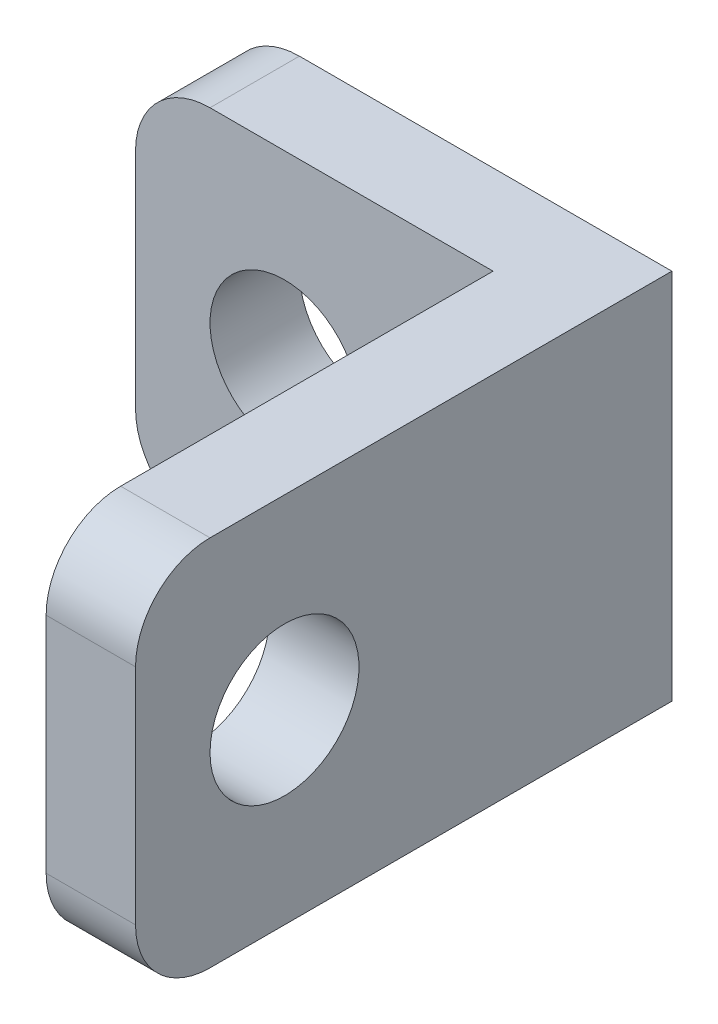
ISO-10303-21;
HEADER;
FILE_DESCRIPTION(('STEP AP214'),'2;1');
FILE_NAME('part.step','',(''),(''),'','','');
FILE_SCHEMA(('AUTOMOTIVE_DESIGN { 1 0 10303 214 1 1 1 1 }'));
ENDSEC;
DATA;
#1=APPLICATION_CONTEXT('core data for automotive mechanical design processes');
#2=APPLICATION_PROTOCOL_DEFINITION('international standard','automotive_design',2000,#1);
#3=PRODUCT_CONTEXT('',#1,'mechanical');
#4=PRODUCT('Part','Part','',(#3));
#5=PRODUCT_RELATED_PRODUCT_CATEGORY('part','',(#4));
#6=PRODUCT_DEFINITION_FORMATION('','',#4);
#7=PRODUCT_DEFINITION_CONTEXT('part definition',#1,'design');
#8=PRODUCT_DEFINITION('design','',#6,#7);
#9=PRODUCT_DEFINITION_SHAPE('','',#8);
#10=(LENGTH_UNIT() NAMED_UNIT(*) SI_UNIT(.MILLI.,.METRE.));
#11=(NAMED_UNIT(*) PLANE_ANGLE_UNIT() SI_UNIT($,.RADIAN.));
#12=(NAMED_UNIT(*) SI_UNIT($,.STERADIAN.) SOLID_ANGLE_UNIT());
#13=UNCERTAINTY_MEASURE_WITH_UNIT(LENGTH_MEASURE(1.E-05),#10,'distance_accuracy_value','');
#14=(GEOMETRIC_REPRESENTATION_CONTEXT(3) GLOBAL_UNCERTAINTY_ASSIGNED_CONTEXT((#13)) GLOBAL_UNIT_ASSIGNED_CONTEXT((#10,
#11,#12)) REPRESENTATION_CONTEXT('',''));
#15=CARTESIAN_POINT('',(0.,0.,0.));
#16=DIRECTION('',(0.,0.,1.));
#17=DIRECTION('',(1.,0.,0.));
#18=AXIS2_PLACEMENT_3D('',#15,#16,#17);
#19=CARTESIAN_POINT('',(1.,4.,1.2));
#20=DIRECTION('',(0.,0.,-1.));
#21=DIRECTION('',(-1.,0.,0.));
#22=AXIS2_PLACEMENT_3D('',#19,#20,#21);
#23=PLANE('',#22);
#24=DIRECTION('',(1.,0.,0.));
#25=VECTOR('',#24,1.);
#26=CARTESIAN_POINT('',(1.00000000000001,0.,1.2));
#27=LINE('',#26,#25);
#28=CARTESIAN_POINT('',(1.00000000000001,0.,1.2));
#29=VERTEX_POINT('',#28);
#30=CARTESIAN_POINT('',(4.8,0.,1.2));
#31=VERTEX_POINT('',#30);
#32=EDGE_CURVE('E123',#29,#31,#27,.T.);
#33=ORIENTED_EDGE('',*,*,#32,.T.);
#34=DIRECTION('',(0.,1.,0.));
#35=VECTOR('',#34,1.);
#36=CARTESIAN_POINT('',(4.8,0.,1.2));
#37=LINE('',#36,#35);
#38=CARTESIAN_POINT('',(4.8,5.,1.2));
#39=VERTEX_POINT('',#38);
#40=EDGE_CURVE('E131',#31,#39,#37,.T.);
#41=ORIENTED_EDGE('',*,*,#40,.T.);
#42=DIRECTION('',(-1.,0.,0.));
#43=VECTOR('',#42,1.);
#44=CARTESIAN_POINT('',(1.,5.,1.2));
#45=LINE('',#44,#43);
#46=CARTESIAN_POINT('',(1.,5.,1.2));
#47=VERTEX_POINT('',#46);
#48=EDGE_CURVE('E165',#39,#47,#45,.T.);
#49=ORIENTED_EDGE('',*,*,#48,.T.);
#50=CARTESIAN_POINT('',(1.,4.,1.2));
#51=DIRECTION('',(0.,0.,1.));
#52=DIRECTION('',(-1.,0.,0.));
#53=AXIS2_PLACEMENT_3D('',#50,#51,#52);
#54=CIRCLE('',#53,1.);
#55=CARTESIAN_POINT('',(0.,4.,1.2));
#56=VERTEX_POINT('',#55);
#57=EDGE_CURVE('E209',#47,#56,#54,.T.);
#58=ORIENTED_EDGE('',*,*,#57,.T.);
#59=DIRECTION('',(0.,-1.,0.));
#60=VECTOR('',#59,1.);
#61=CARTESIAN_POINT('',(0.,1.00000000000001,1.2));
#62=LINE('',#61,#60);
#63=CARTESIAN_POINT('',(0.,1.00000000000001,1.2));
#64=VERTEX_POINT('',#63);
#65=EDGE_CURVE('E147',#56,#64,#62,.T.);
#66=ORIENTED_EDGE('',*,*,#65,.T.);
#67=CARTESIAN_POINT('',(1.,1.,1.2));
#68=DIRECTION('',(0.,0.,1.));
#69=DIRECTION('',(-1.,0.,0.));
#70=AXIS2_PLACEMENT_3D('',#67,#68,#69);
#71=CIRCLE('',#70,1.);
#72=EDGE_CURVE('E141',#64,#29,#71,.T.);
#73=ORIENTED_EDGE('',*,*,#72,.T.);
#74=EDGE_LOOP('',(#33,#41,#49,#58,#66,#73));
#75=FACE_BOUND('',#74,.T.);
#76=CARTESIAN_POINT('',(2.,2.5,1.2));
#77=DIRECTION('',(0.,0.,1.));
#78=DIRECTION('',(1.,0.,0.));
#79=AXIS2_PLACEMENT_3D('',#76,#77,#78);
#80=CIRCLE('',#79,1.);
#81=CARTESIAN_POINT('',(3.,2.5,1.2));
#82=VERTEX_POINT('',#81);
#83=EDGE_CURVE('E155',#82,#82,#80,.T.);
#84=ORIENTED_EDGE('',*,*,#83,.F.);
#85=EDGE_LOOP('',(#84));
#86=FACE_BOUND('',#85,.T.);
#87=ADVANCED_FACE('F37',(#75,#86),#23,.F.);
#88=CARTESIAN_POINT('',(1.,4.,0.));
#89=DIRECTION('',(0.,0.,-1.));
#90=DIRECTION('',(-1.,0.,0.));
#91=AXIS2_PLACEMENT_3D('',#88,#89,#90);
#92=PLANE('',#91);
#93=DIRECTION('',(0.,1.,0.));
#94=VECTOR('',#93,1.);
#95=CARTESIAN_POINT('',(6.,0.,0.));
#96=LINE('',#95,#94);
#97=CARTESIAN_POINT('',(6.,0.,0.));
#98=VERTEX_POINT('',#97);
#99=CARTESIAN_POINT('',(6.,5.,0.));
#100=VERTEX_POINT('',#99);
#101=EDGE_CURVE('E151',#98,#100,#96,.T.);
#102=ORIENTED_EDGE('',*,*,#101,.F.);
#103=DIRECTION('',(1.,0.,0.));
#104=VECTOR('',#103,1.);
#105=CARTESIAN_POINT('',(1.00000000000001,0.,0.));
#106=LINE('',#105,#104);
#107=CARTESIAN_POINT('',(1.00000000000001,0.,0.));
#108=VERTEX_POINT('',#107);
#109=EDGE_CURVE('E163',#108,#98,#106,.T.);
#110=ORIENTED_EDGE('',*,*,#109,.F.);
#111=CARTESIAN_POINT('',(1.,1.,0.));
#112=DIRECTION('',(0.,0.,1.));
#113=DIRECTION('',(-1.,0.,0.));
#114=AXIS2_PLACEMENT_3D('',#111,#112,#113);
#115=CIRCLE('',#114,1.);
#116=CARTESIAN_POINT('',(0.,1.00000000000001,0.));
#117=VERTEX_POINT('',#116);
#118=EDGE_CURVE('E161',#117,#108,#115,.T.);
#119=ORIENTED_EDGE('',*,*,#118,.F.);
#120=DIRECTION('',(0.,-1.,0.));
#121=VECTOR('',#120,1.);
#122=CARTESIAN_POINT('',(0.,1.00000000000001,0.));
#123=LINE('',#122,#121);
#124=CARTESIAN_POINT('',(0.,4.,0.));
#125=VERTEX_POINT('',#124);
#126=EDGE_CURVE('E159',#125,#117,#123,.T.);
#127=ORIENTED_EDGE('',*,*,#126,.F.);
#128=CARTESIAN_POINT('',(1.,4.,0.));
#129=DIRECTION('',(0.,0.,1.));
#130=DIRECTION('',(-1.,0.,0.));
#131=AXIS2_PLACEMENT_3D('',#128,#129,#130);
#132=CIRCLE('',#131,1.);
#133=CARTESIAN_POINT('',(1.,5.,0.));
#134=VERTEX_POINT('',#133);
#135=EDGE_CURVE('E157',#134,#125,#132,.T.);
#136=ORIENTED_EDGE('',*,*,#135,.F.);
#137=DIRECTION('',(-1.,0.,0.));
#138=VECTOR('',#137,1.);
#139=CARTESIAN_POINT('',(1.,5.,0.));
#140=LINE('',#139,#138);
#141=EDGE_CURVE('E154',#100,#134,#140,.T.);
#142=ORIENTED_EDGE('',*,*,#141,.F.);
#143=EDGE_LOOP('',(#102,#110,#119,#127,#136,#142));
#144=FACE_BOUND('',#143,.T.);
#145=CARTESIAN_POINT('',(2.,2.5,0.));
#146=DIRECTION('',(0.,0.,1.));
#147=DIRECTION('',(1.,0.,0.));
#148=AXIS2_PLACEMENT_3D('',#145,#146,#147);
#149=CIRCLE('',#148,1.);
#150=CARTESIAN_POINT('',(3.,2.5,0.));
#151=VERTEX_POINT('',#150);
#152=EDGE_CURVE('E127',#151,#151,#149,.T.);
#153=ORIENTED_EDGE('',*,*,#152,.T.);
#154=EDGE_LOOP('',(#153));
#155=FACE_BOUND('',#154,.T.);
#156=ADVANCED_FACE('F221',(#144,#155),#92,.T.);
#157=CARTESIAN_POINT('',(6.,0.,1.2));
#158=DIRECTION('',(-1.,0.,0.));
#159=DIRECTION('',(0.,0.,1.));
#160=AXIS2_PLACEMENT_3D('',#157,#158,#159);
#161=PLANE('',#160);
#162=CARTESIAN_POINT('',(6.,2.5,5.2));
#163=DIRECTION('',(-1.,0.,0.));
#164=DIRECTION('',(0.,0.,1.));
#165=AXIS2_PLACEMENT_3D('',#162,#163,#164);
#166=CIRCLE('',#165,0.999999999999998);
#167=CARTESIAN_POINT('',(6.,2.5,6.2));
#168=VERTEX_POINT('',#167);
#169=EDGE_CURVE('E137',#168,#168,#166,.T.);
#170=ORIENTED_EDGE('',*,*,#169,.T.);
#171=EDGE_LOOP('',(#170));
#172=FACE_BOUND('',#171,.T.);
#173=DIRECTION('',(0.,-1.,0.));
#174=VECTOR('',#173,1.);
#175=CARTESIAN_POINT('',(6.,0.,7.2));
#176=LINE('',#175,#174);
#177=CARTESIAN_POINT('',(6.,4.,7.2));
#178=VERTEX_POINT('',#177);
#179=CARTESIAN_POINT('',(6.,1.,7.2));
#180=VERTEX_POINT('',#179);
#181=EDGE_CURVE('E190',#178,#180,#176,.T.);
#182=ORIENTED_EDGE('',*,*,#181,.T.);
#183=CARTESIAN_POINT('',(6.,1.,6.2));
#184=DIRECTION('',(-1.,0.,0.));
#185=DIRECTION('',(0.,0.,1.));
#186=AXIS2_PLACEMENT_3D('',#183,#184,#185);
#187=CIRCLE('',#186,1.);
#188=CARTESIAN_POINT('',(6.,0.,6.2));
#189=VERTEX_POINT('',#188);
#190=EDGE_CURVE('E45',#180,#189,#187,.F.);
#191=ORIENTED_EDGE('',*,*,#190,.T.);
#192=DIRECTION('',(0.,0.,-1.));
#193=VECTOR('',#192,1.);
#194=CARTESIAN_POINT('',(6.,0.,1.2));
#195=LINE('',#194,#193);
#196=EDGE_CURVE('E143',#189,#98,#195,.T.);
#197=ORIENTED_EDGE('',*,*,#196,.T.);
#198=ORIENTED_EDGE('',*,*,#101,.T.);
#199=DIRECTION('',(0.,0.,-1.));
#200=VECTOR('',#199,1.);
#201=CARTESIAN_POINT('',(6.,5.,1.2));
#202=LINE('',#201,#200);
#203=CARTESIAN_POINT('',(6.,5.,6.2));
#204=VERTEX_POINT('',#203);
#205=EDGE_CURVE('E177',#204,#100,#202,.T.);
#206=ORIENTED_EDGE('',*,*,#205,.F.);
#207=CARTESIAN_POINT('',(6.,4.,6.2));
#208=DIRECTION('',(-1.,0.,0.));
#209=DIRECTION('',(0.,0.,1.));
#210=AXIS2_PLACEMENT_3D('',#207,#208,#209);
#211=CIRCLE('',#210,1.);
#212=EDGE_CURVE('E52',#204,#178,#211,.F.);
#213=ORIENTED_EDGE('',*,*,#212,.T.);
#214=EDGE_LOOP('',(#182,#191,#197,#198,#206,#213));
#215=FACE_BOUND('',#214,.T.);
#216=ADVANCED_FACE('F189',(#172,#215),#161,.F.);
#217=CARTESIAN_POINT('',(1.,5.,1.2));
#218=DIRECTION('',(0.,-1.,0.));
#219=DIRECTION('',(1.,0.,0.));
#220=AXIS2_PLACEMENT_3D('',#217,#218,#219);
#221=PLANE('',#220);
#222=DIRECTION('',(0.,0.,-1.));
#223=VECTOR('',#222,1.);
#224=CARTESIAN_POINT('',(4.8,5.,7.2));
#225=LINE('',#224,#223);
#226=CARTESIAN_POINT('',(4.8,5.,6.2));
#227=VERTEX_POINT('',#226);
#228=EDGE_CURVE('E128',#227,#39,#225,.T.);
#229=ORIENTED_EDGE('',*,*,#228,.F.);
#230=DIRECTION('',(1.,0.,0.));
#231=VECTOR('',#230,1.);
#232=CARTESIAN_POINT('',(1.,5.,6.2));
#233=LINE('',#232,#231);
#234=EDGE_CURVE('E11',#227,#204,#233,.T.);
#235=ORIENTED_EDGE('',*,*,#234,.T.);
#236=ORIENTED_EDGE('',*,*,#205,.T.);
#237=ORIENTED_EDGE('',*,*,#141,.T.);
#238=DIRECTION('',(0.,0.,-1.));
#239=VECTOR('',#238,1.);
#240=CARTESIAN_POINT('',(1.,5.,1.2));
#241=LINE('',#240,#239);
#242=EDGE_CURVE('E174',#47,#134,#241,.T.);
#243=ORIENTED_EDGE('',*,*,#242,.F.);
#244=ORIENTED_EDGE('',*,*,#48,.F.);
#245=EDGE_LOOP('',(#229,#235,#236,#237,#243,#244));
#246=FACE_BOUND('',#245,.T.);
#247=ADVANCED_FACE('F227',(#246),#221,.F.);
#248=CARTESIAN_POINT('',(1.,4.,1.2));
#249=DIRECTION('',(0.,0.,-1.));
#250=DIRECTION('',(-1.,0.,0.));
#251=AXIS2_PLACEMENT_3D('',#248,#249,#250);
#252=CYLINDRICAL_SURFACE('',#251,1.);
#253=ORIENTED_EDGE('',*,*,#135,.T.);
#254=DIRECTION('',(0.,0.,-1.));
#255=VECTOR('',#254,1.);
#256=CARTESIAN_POINT('',(0.,4.,1.2));
#257=LINE('',#256,#255);
#258=EDGE_CURVE('E171',#56,#125,#257,.T.);
#259=ORIENTED_EDGE('',*,*,#258,.F.);
#260=ORIENTED_EDGE('',*,*,#57,.F.);
#261=ORIENTED_EDGE('',*,*,#242,.T.);
#262=EDGE_LOOP('',(#253,#259,#260,#261));
#263=FACE_BOUND('',#262,.T.);
#264=ADVANCED_FACE('F253',(#263),#252,.T.);
#265=CARTESIAN_POINT('',(0.,1.00000000000001,1.2));
#266=DIRECTION('',(1.,0.,0.));
#267=DIRECTION('',(0.,0.,-1.));
#268=AXIS2_PLACEMENT_3D('',#265,#266,#267);
#269=PLANE('',#268);
#270=ORIENTED_EDGE('',*,*,#126,.T.);
#271=DIRECTION('',(0.,0.,-1.));
#272=VECTOR('',#271,1.);
#273=CARTESIAN_POINT('',(0.,1.00000000000001,1.2));
#274=LINE('',#273,#272);
#275=EDGE_CURVE('E168',#64,#117,#274,.T.);
#276=ORIENTED_EDGE('',*,*,#275,.F.);
#277=ORIENTED_EDGE('',*,*,#65,.F.);
#278=ORIENTED_EDGE('',*,*,#258,.T.);
#279=EDGE_LOOP('',(#270,#276,#277,#278));
#280=FACE_BOUND('',#279,.T.);
#281=ADVANCED_FACE('F215',(#280),#269,.F.);
#282=CARTESIAN_POINT('',(1.,1.,1.2));
#283=DIRECTION('',(0.,0.,-1.));
#284=DIRECTION('',(-1.,0.,0.));
#285=AXIS2_PLACEMENT_3D('',#282,#283,#284);
#286=CYLINDRICAL_SURFACE('',#285,1.);
#287=ORIENTED_EDGE('',*,*,#118,.T.);
#288=DIRECTION('',(0.,0.,-1.));
#289=VECTOR('',#288,1.);
#290=CARTESIAN_POINT('',(1.00000000000001,0.,1.2));
#291=LINE('',#290,#289);
#292=EDGE_CURVE('E145',#29,#108,#291,.T.);
#293=ORIENTED_EDGE('',*,*,#292,.F.);
#294=ORIENTED_EDGE('',*,*,#72,.F.);
#295=ORIENTED_EDGE('',*,*,#275,.T.);
#296=EDGE_LOOP('',(#287,#293,#294,#295));
#297=FACE_BOUND('',#296,.T.);
#298=ADVANCED_FACE('F219',(#297),#286,.T.);
#299=CARTESIAN_POINT('',(1.00000000000001,0.,1.2));
#300=DIRECTION('',(0.,1.,0.));
#301=DIRECTION('',(0.,0.,1.));
#302=AXIS2_PLACEMENT_3D('',#299,#300,#301);
#303=PLANE('',#302);
#304=ORIENTED_EDGE('',*,*,#196,.F.);
#305=DIRECTION('',(-1.,0.,0.));
#306=VECTOR('',#305,1.);
#307=CARTESIAN_POINT('',(1.00000000000001,0.,6.2));
#308=LINE('',#307,#306);
#309=CARTESIAN_POINT('',(4.8,0.,6.2));
#310=VERTEX_POINT('',#309);
#311=EDGE_CURVE('E125',#189,#310,#308,.T.);
#312=ORIENTED_EDGE('',*,*,#311,.T.);
#313=DIRECTION('',(0.,0.,-1.));
#314=VECTOR('',#313,1.);
#315=CARTESIAN_POINT('',(4.8,0.,7.2));
#316=LINE('',#315,#314);
#317=EDGE_CURVE('E117',#310,#31,#316,.T.);
#318=ORIENTED_EDGE('',*,*,#317,.T.);
#319=ORIENTED_EDGE('',*,*,#32,.F.);
#320=ORIENTED_EDGE('',*,*,#292,.T.);
#321=ORIENTED_EDGE('',*,*,#109,.T.);
#322=EDGE_LOOP('',(#304,#312,#318,#319,#320,#321));
#323=FACE_BOUND('',#322,.T.);
#324=ADVANCED_FACE('F120',(#323),#303,.F.);
#325=CARTESIAN_POINT('',(2.,2.5,1.2));
#326=DIRECTION('',(0.,0.,-1.));
#327=DIRECTION('',(-1.,0.,0.));
#328=AXIS2_PLACEMENT_3D('',#325,#326,#327);
#329=CYLINDRICAL_SURFACE('',#328,1.);
#330=ORIENTED_EDGE('',*,*,#83,.T.);
#331=EDGE_LOOP('',(#330));
#332=FACE_BOUND('',#331,.T.);
#333=ORIENTED_EDGE('',*,*,#152,.F.);
#334=EDGE_LOOP('',(#333));
#335=FACE_BOUND('',#334,.T.);
#336=ADVANCED_FACE('F244',(#332,#335),#329,.F.);
#337=CARTESIAN_POINT('',(4.8,0.,7.2));
#338=DIRECTION('',(-1.,0.,0.));
#339=DIRECTION('',(0.,0.,1.));
#340=AXIS2_PLACEMENT_3D('',#337,#338,#339);
#341=PLANE('',#340);
#342=CARTESIAN_POINT('',(4.8,2.5,5.2));
#343=DIRECTION('',(-1.,0.,0.));
#344=DIRECTION('',(0.,0.,1.));
#345=AXIS2_PLACEMENT_3D('',#342,#343,#344);
#346=CIRCLE('',#345,0.999999999999998);
#347=CARTESIAN_POINT('',(4.8,2.5,6.2));
#348=VERTEX_POINT('',#347);
#349=EDGE_CURVE('E266',#348,#348,#346,.T.);
#350=ORIENTED_EDGE('',*,*,#349,.F.);
#351=EDGE_LOOP('',(#350));
#352=FACE_BOUND('',#351,.T.);
#353=ORIENTED_EDGE('',*,*,#317,.F.);
#354=CARTESIAN_POINT('',(4.8,1.,6.2));
#355=DIRECTION('',(-1.,0.,0.));
#356=DIRECTION('',(0.,0.,1.));
#357=AXIS2_PLACEMENT_3D('',#354,#355,#356);
#358=CIRCLE('',#357,1.);
#359=CARTESIAN_POINT('',(4.8,1.,7.2));
#360=VERTEX_POINT('',#359);
#361=EDGE_CURVE('E182',#310,#360,#358,.T.);
#362=ORIENTED_EDGE('',*,*,#361,.T.);
#363=DIRECTION('',(0.,1.,0.));
#364=VECTOR('',#363,1.);
#365=CARTESIAN_POINT('',(4.8,0.,7.2));
#366=LINE('',#365,#364);
#367=CARTESIAN_POINT('',(4.8,4.,7.2));
#368=VERTEX_POINT('',#367);
#369=EDGE_CURVE('E136',#360,#368,#366,.T.);
#370=ORIENTED_EDGE('',*,*,#369,.T.);
#371=CARTESIAN_POINT('',(4.8,4.,6.2));
#372=DIRECTION('',(-1.,0.,0.));
#373=DIRECTION('',(0.,0.,1.));
#374=AXIS2_PLACEMENT_3D('',#371,#372,#373);
#375=CIRCLE('',#374,1.);
#376=EDGE_CURVE('E180',#368,#227,#375,.T.);
#377=ORIENTED_EDGE('',*,*,#376,.T.);
#378=ORIENTED_EDGE('',*,*,#228,.T.);
#379=ORIENTED_EDGE('',*,*,#40,.F.);
#380=EDGE_LOOP('',(#353,#362,#370,#377,#378,#379));
#381=FACE_BOUND('',#380,.T.);
#382=ADVANCED_FACE('F132',(#352,#381),#341,.T.);
#383=CARTESIAN_POINT('',(0.,0.,7.2));
#384=DIRECTION('',(0.,0.,-1.));
#385=DIRECTION('',(-1.,0.,0.));
#386=AXIS2_PLACEMENT_3D('',#383,#384,#385);
#387=PLANE('',#386);
#388=ORIENTED_EDGE('',*,*,#369,.F.);
#389=DIRECTION('',(-1.,0.,0.));
#390=VECTOR('',#389,1.);
#391=CARTESIAN_POINT('',(0.,1.,7.2));
#392=LINE('',#391,#390);
#393=EDGE_CURVE('E59',#360,#180,#392,.F.);
#394=ORIENTED_EDGE('',*,*,#393,.T.);
#395=ORIENTED_EDGE('',*,*,#181,.F.);
#396=DIRECTION('',(1.,0.,0.));
#397=VECTOR('',#396,1.);
#398=CARTESIAN_POINT('',(0.,4.,7.2));
#399=LINE('',#398,#397);
#400=EDGE_CURVE('E184',#178,#368,#399,.F.);
#401=ORIENTED_EDGE('',*,*,#400,.T.);
#402=EDGE_LOOP('',(#388,#394,#395,#401));
#403=FACE_BOUND('',#402,.T.);
#404=ADVANCED_FACE('F197',(#403),#387,.F.);
#405=CARTESIAN_POINT('',(1.00000000000001,1.,6.2));
#406=DIRECTION('',(-1.,0.,0.));
#407=DIRECTION('',(0.,0.,1.));
#408=AXIS2_PLACEMENT_3D('',#405,#406,#407);
#409=CYLINDRICAL_SURFACE('',#408,1.);
#410=ORIENTED_EDGE('',*,*,#190,.F.);
#411=ORIENTED_EDGE('',*,*,#393,.F.);
#412=ORIENTED_EDGE('',*,*,#361,.F.);
#413=ORIENTED_EDGE('',*,*,#311,.F.);
#414=EDGE_LOOP('',(#410,#411,#412,#413));
#415=FACE_BOUND('',#414,.T.);
#416=ADVANCED_FACE('F194',(#415),#409,.T.);
#417=CARTESIAN_POINT('',(1.,4.,6.2));
#418=DIRECTION('',(1.,0.,0.));
#419=DIRECTION('',(0.,1.,0.));
#420=AXIS2_PLACEMENT_3D('',#417,#418,#419);
#421=CYLINDRICAL_SURFACE('',#420,1.);
#422=ORIENTED_EDGE('',*,*,#376,.F.);
#423=ORIENTED_EDGE('',*,*,#400,.F.);
#424=ORIENTED_EDGE('',*,*,#212,.F.);
#425=ORIENTED_EDGE('',*,*,#234,.F.);
#426=EDGE_LOOP('',(#422,#423,#424,#425));
#427=FACE_BOUND('',#426,.T.);
#428=ADVANCED_FACE('F39',(#427),#421,.T.);
#429=CARTESIAN_POINT('',(6.8,2.5,5.2));
#430=DIRECTION('',(-1.,0.,0.));
#431=DIRECTION('',(0.,0.,1.));
#432=AXIS2_PLACEMENT_3D('',#429,#430,#431);
#433=CYLINDRICAL_SURFACE('',#432,0.999999999999998);
#434=ORIENTED_EDGE('',*,*,#349,.T.);
#435=EDGE_LOOP('',(#434));
#436=FACE_BOUND('',#435,.T.);
#437=ORIENTED_EDGE('',*,*,#169,.F.);
#438=EDGE_LOOP('',(#437));
#439=FACE_BOUND('',#438,.T.);
#440=ADVANCED_FACE('F230',(#436,#439),#433,.F.);
#441=CLOSED_SHELL('',(#87,#156,#216,#247,#264,#281,#298,#324,#336,#382,#404,#416,#428,#440));
#442=MANIFOLD_SOLID_BREP('B2',#441);
#443=ADVANCED_BREP_SHAPE_REPRESENTATION('',(#18,#442),#14);
#444=SHAPE_DEFINITION_REPRESENTATION(#9,#443);
ENDSEC;
END-ISO-10303-21;
